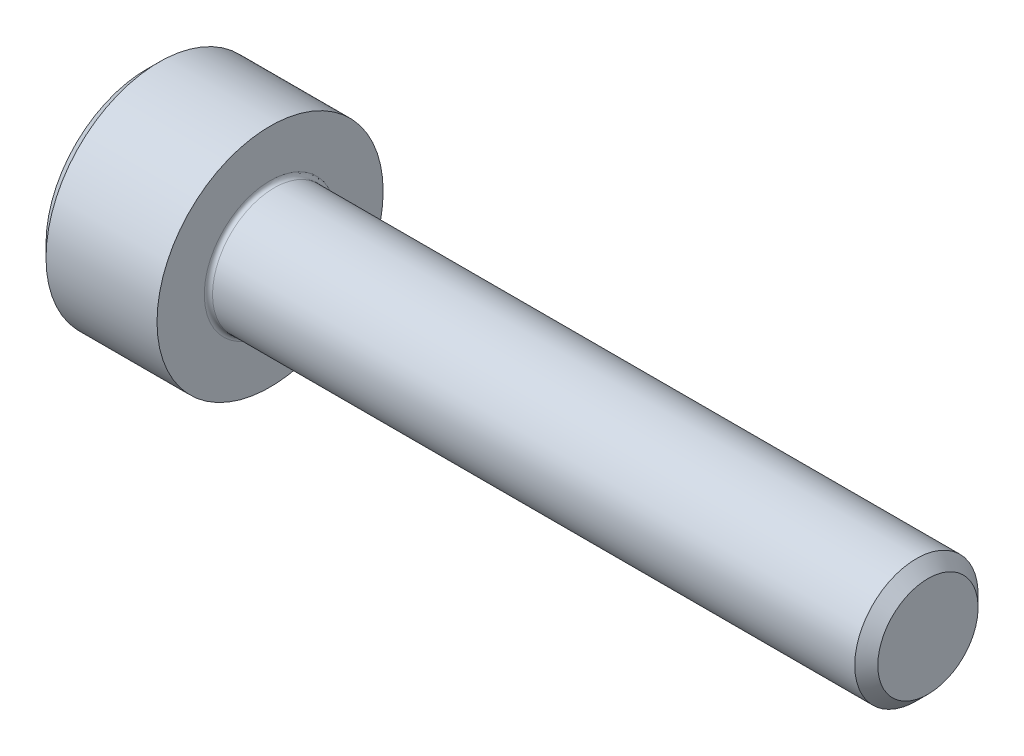
ISO-10303-21;
HEADER;
FILE_DESCRIPTION(('STEP AP214'),'2;1');
FILE_NAME('part.step','',(''),(''),'','','');
FILE_SCHEMA(('AUTOMOTIVE_DESIGN { 1 0 10303 214 1 1 1 1 }'));
ENDSEC;
DATA;
#1=APPLICATION_CONTEXT('core data for automotive mechanical design processes');
#2=APPLICATION_PROTOCOL_DEFINITION('international standard','automotive_design',2000,#1);
#3=PRODUCT_CONTEXT('',#1,'mechanical');
#4=PRODUCT('Part','Part','',(#3));
#5=PRODUCT_RELATED_PRODUCT_CATEGORY('part','',(#4));
#6=PRODUCT_DEFINITION_FORMATION('','',#4);
#7=PRODUCT_DEFINITION_CONTEXT('part definition',#1,'design');
#8=PRODUCT_DEFINITION('design','',#6,#7);
#9=PRODUCT_DEFINITION_SHAPE('','',#8);
#10=(LENGTH_UNIT() NAMED_UNIT(*) SI_UNIT(.MILLI.,.METRE.));
#11=(NAMED_UNIT(*) PLANE_ANGLE_UNIT() SI_UNIT($,.RADIAN.));
#12=(NAMED_UNIT(*) SI_UNIT($,.STERADIAN.) SOLID_ANGLE_UNIT());
#13=UNCERTAINTY_MEASURE_WITH_UNIT(LENGTH_MEASURE(1.E-05),#10,'distance_accuracy_value','');
#14=(GEOMETRIC_REPRESENTATION_CONTEXT(3) GLOBAL_UNCERTAINTY_ASSIGNED_CONTEXT((#13)) GLOBAL_UNIT_ASSIGNED_CONTEXT((#10,
#11,#12)) REPRESENTATION_CONTEXT('',''));
#15=CARTESIAN_POINT('',(0.,0.,0.));
#16=DIRECTION('',(0.,0.,1.));
#17=DIRECTION('',(1.,0.,0.));
#18=AXIS2_PLACEMENT_3D('',#15,#16,#17);
#19=CARTESIAN_POINT('',(0.,0.,0.));
#20=DIRECTION('',(-1.,0.,0.));
#21=DIRECTION('',(0.,0.,1.));
#22=AXIS2_PLACEMENT_3D('',#19,#20,#21);
#23=PLANE('',#22);
#24=DIRECTION('',(0.,-0.5,0.86602540378444));
#25=VECTOR('',#24,1.);
#26=CARTESIAN_POINT('',(0.,1.47801668912544,0.));
#27=LINE('',#26,#25);
#28=CARTESIAN_POINT('',(0.,1.47801668912544,0.));
#29=VERTEX_POINT('',#28);
#30=CARTESIAN_POINT('',(0.,0.73900834456272,1.28));
#31=VERTEX_POINT('',#30);
#32=EDGE_CURVE('E247',#29,#31,#27,.T.);
#33=ORIENTED_EDGE('',*,*,#32,.T.);
#34=DIRECTION('',(0.,1.,0.));
#35=VECTOR('',#34,1.);
#36=CARTESIAN_POINT('',(0.,-0.739008344562722,1.28));
#37=LINE('',#36,#35);
#38=CARTESIAN_POINT('',(0.,-0.739008344562722,1.28));
#39=VERTEX_POINT('',#38);
#40=EDGE_CURVE('E113',#39,#31,#37,.T.);
#41=ORIENTED_EDGE('',*,*,#40,.F.);
#42=DIRECTION('',(0.,-0.5,-0.866025403784438));
#43=VECTOR('',#42,1.);
#44=CARTESIAN_POINT('',(0.,-0.739008344562722,1.28));
#45=LINE('',#44,#43);
#46=CARTESIAN_POINT('',(0.,-1.47801668912544,0.));
#47=VERTEX_POINT('',#46);
#48=EDGE_CURVE('E250',#39,#47,#45,.T.);
#49=ORIENTED_EDGE('',*,*,#48,.T.);
#50=DIRECTION('',(0.,0.5,-0.86602540378444));
#51=VECTOR('',#50,1.);
#52=CARTESIAN_POINT('',(0.,-1.47801668912544,0.));
#53=LINE('',#52,#51);
#54=CARTESIAN_POINT('',(0.,-0.739008344562726,-1.28));
#55=VERTEX_POINT('',#54);
#56=EDGE_CURVE('E253',#47,#55,#53,.T.);
#57=ORIENTED_EDGE('',*,*,#56,.T.);
#58=DIRECTION('',(0.,-1.,0.));
#59=VECTOR('',#58,1.);
#60=CARTESIAN_POINT('',(0.,0.739008344562716,-1.28));
#61=LINE('',#60,#59);
#62=CARTESIAN_POINT('',(0.,0.739008344562716,-1.28));
#63=VERTEX_POINT('',#62);
#64=EDGE_CURVE('E256',#63,#55,#61,.T.);
#65=ORIENTED_EDGE('',*,*,#64,.F.);
#66=DIRECTION('',(0.,-0.5,-0.866025403784438));
#67=VECTOR('',#66,1.);
#68=CARTESIAN_POINT('',(0.,1.47801668912544,0.));
#69=LINE('',#68,#67);
#70=EDGE_CURVE('E108',#29,#63,#69,.T.);
#71=ORIENTED_EDGE('',*,*,#70,.F.);
#72=EDGE_LOOP('',(#33,#41,#49,#57,#65,#71));
#73=FACE_BOUND('',#72,.T.);
#74=CARTESIAN_POINT('',(0.,0.,0.));
#75=DIRECTION('',(-1.,0.,0.));
#76=DIRECTION('',(0.,0.,1.));
#77=AXIS2_PLACEMENT_3D('',#74,#75,#76);
#78=CIRCLE('',#77,2.45);
#79=CARTESIAN_POINT('',(0.,0.,2.45));
#80=VERTEX_POINT('',#79);
#81=EDGE_CURVE('E137',#80,#80,#78,.T.);
#82=ORIENTED_EDGE('',*,*,#81,.T.);
#83=EDGE_LOOP('',(#82));
#84=FACE_BOUND('',#83,.T.);
#85=ADVANCED_FACE('F17',(#73,#84),#23,.T.);
#86=CARTESIAN_POINT('',(0.,0.,0.));
#87=DIRECTION('',(1.,0.,0.));
#88=DIRECTION('',(0.,0.,-1.));
#89=AXIS2_PLACEMENT_3D('',#86,#87,#88);
#90=CONICAL_SURFACE('',#89,2.45,0.785398163397447);
#91=CARTESIAN_POINT('',(0.3,0.,0.));
#92=DIRECTION('',(-1.,0.,0.));
#93=DIRECTION('',(0.,0.,1.));
#94=AXIS2_PLACEMENT_3D('',#91,#92,#93);
#95=CIRCLE('',#94,2.75);
#96=CARTESIAN_POINT('',(0.3,0.,2.75));
#97=VERTEX_POINT('',#96);
#98=EDGE_CURVE('E134',#97,#97,#95,.T.);
#99=ORIENTED_EDGE('',*,*,#98,.T.);
#100=EDGE_LOOP('',(#99));
#101=FACE_BOUND('',#100,.T.);
#102=ORIENTED_EDGE('',*,*,#81,.F.);
#103=EDGE_LOOP('',(#102));
#104=FACE_BOUND('',#103,.T.);
#105=ADVANCED_FACE('F160',(#101,#104),#90,.T.);
#106=CARTESIAN_POINT('',(-31.75,0.,0.));
#107=DIRECTION('',(-1.,0.,0.));
#108=DIRECTION('',(0.,0.,1.));
#109=AXIS2_PLACEMENT_3D('',#106,#107,#108);
#110=CYLINDRICAL_SURFACE('',#109,2.75);
#111=CARTESIAN_POINT('',(3.,0.,0.));
#112=DIRECTION('',(-1.,0.,0.));
#113=DIRECTION('',(0.,0.,1.));
#114=AXIS2_PLACEMENT_3D('',#111,#112,#113);
#115=CIRCLE('',#114,2.75);
#116=CARTESIAN_POINT('',(3.,0.,2.75));
#117=VERTEX_POINT('',#116);
#118=EDGE_CURVE('E131',#117,#117,#115,.T.);
#119=ORIENTED_EDGE('',*,*,#118,.T.);
#120=EDGE_LOOP('',(#119));
#121=FACE_BOUND('',#120,.T.);
#122=ORIENTED_EDGE('',*,*,#98,.F.);
#123=EDGE_LOOP('',(#122));
#124=FACE_BOUND('',#123,.T.);
#125=ADVANCED_FACE('F166',(#121,#124),#110,.T.);
#126=CARTESIAN_POINT('',(3.,2.75,0.));
#127=DIRECTION('',(1.,0.,0.));
#128=DIRECTION('',(0.,0.,-1.));
#129=AXIS2_PLACEMENT_3D('',#126,#127,#128);
#130=PLANE('',#129);
#131=CARTESIAN_POINT('',(3.,0.,0.));
#132=DIRECTION('',(1.,0.,0.));
#133=DIRECTION('',(0.,0.,-1.));
#134=AXIS2_PLACEMENT_3D('',#131,#132,#133);
#135=CIRCLE('',#134,1.6);
#136=CARTESIAN_POINT('',(3.,0.,-1.6));
#137=VERTEX_POINT('',#136);
#138=EDGE_CURVE('E25',#137,#137,#135,.F.);
#139=ORIENTED_EDGE('',*,*,#138,.T.);
#140=EDGE_LOOP('',(#139));
#141=FACE_BOUND('',#140,.T.);
#142=ORIENTED_EDGE('',*,*,#118,.F.);
#143=EDGE_LOOP('',(#142));
#144=FACE_BOUND('',#143,.T.);
#145=ADVANCED_FACE('F142',(#141,#144),#130,.T.);
#146=CARTESIAN_POINT('',(-31.75,0.,0.));
#147=DIRECTION('',(-1.,0.,0.));
#148=DIRECTION('',(0.,0.,1.));
#149=AXIS2_PLACEMENT_3D('',#146,#147,#148);
#150=CYLINDRICAL_SURFACE('',#149,1.5);
#151=CARTESIAN_POINT('',(3.1,0.,0.));
#152=DIRECTION('',(1.,0.,0.));
#153=DIRECTION('',(0.,0.,-1.));
#154=AXIS2_PLACEMENT_3D('',#151,#152,#153);
#155=CIRCLE('',#154,1.5);
#156=CARTESIAN_POINT('',(3.1,0.,-1.5));
#157=VERTEX_POINT('',#156);
#158=EDGE_CURVE('E11',#157,#157,#155,.T.);
#159=ORIENTED_EDGE('',*,*,#158,.T.);
#160=EDGE_LOOP('',(#159));
#161=FACE_BOUND('',#160,.T.);
#162=CARTESIAN_POINT('',(18.7195,0.,0.));
#163=DIRECTION('',(-1.,0.,0.));
#164=DIRECTION('',(0.,0.,1.));
#165=AXIS2_PLACEMENT_3D('',#162,#163,#164);
#166=CIRCLE('',#165,1.49999999999998);
#167=CARTESIAN_POINT('',(18.7195,0.,1.49999999999998));
#168=VERTEX_POINT('',#167);
#169=EDGE_CURVE('E128',#168,#168,#166,.T.);
#170=ORIENTED_EDGE('',*,*,#169,.T.);
#171=EDGE_LOOP('',(#170));
#172=FACE_BOUND('',#171,.T.);
#173=ADVANCED_FACE('F176',(#161,#172),#150,.T.);
#174=CARTESIAN_POINT('',(19.,0.,0.));
#175=DIRECTION('',(-1.,0.,0.));
#176=DIRECTION('',(0.,0.,1.));
#177=AXIS2_PLACEMENT_3D('',#174,#175,#176);
#178=CONICAL_SURFACE('',#177,1.2195,0.785398163397381);
#179=ORIENTED_EDGE('',*,*,#169,.F.);
#180=EDGE_LOOP('',(#179));
#181=FACE_BOUND('',#180,.T.);
#182=CARTESIAN_POINT('',(19.,0.,0.));
#183=DIRECTION('',(-1.,0.,0.));
#184=DIRECTION('',(0.,0.,1.));
#185=AXIS2_PLACEMENT_3D('',#182,#183,#184);
#186=CIRCLE('',#185,1.2195);
#187=CARTESIAN_POINT('',(19.,0.,1.2195));
#188=VERTEX_POINT('',#187);
#189=EDGE_CURVE('E124',#188,#188,#186,.T.);
#190=ORIENTED_EDGE('',*,*,#189,.T.);
#191=EDGE_LOOP('',(#190));
#192=FACE_BOUND('',#191,.T.);
#193=ADVANCED_FACE('F155',(#181,#192),#178,.T.);
#194=CARTESIAN_POINT('',(19.,1.2195,0.));
#195=DIRECTION('',(1.,0.,0.));
#196=DIRECTION('',(0.,0.,-1.));
#197=AXIS2_PLACEMENT_3D('',#194,#195,#196);
#198=PLANE('',#197);
#199=ORIENTED_EDGE('',*,*,#189,.F.);
#200=EDGE_LOOP('',(#199));
#201=FACE_BOUND('',#200,.T.);
#202=ADVANCED_FACE('F146',(#201),#198,.T.);
#203=CARTESIAN_POINT('',(3.1,0.,0.));
#204=DIRECTION('',(1.,0.,0.));
#205=DIRECTION('',(0.,0.,-1.));
#206=AXIS2_PLACEMENT_3D('',#203,#204,#205);
#207=TOROIDAL_SURFACE('',#206,1.6,0.1);
#208=ORIENTED_EDGE('',*,*,#158,.F.);
#209=EDGE_LOOP('',(#208));
#210=FACE_BOUND('',#209,.T.);
#211=ORIENTED_EDGE('',*,*,#138,.F.);
#212=EDGE_LOOP('',(#211));
#213=FACE_BOUND('',#212,.T.);
#214=ADVANCED_FACE('F19',(#210,#213),#207,.F.);
#215=CARTESIAN_POINT('',(1.3,1.47801668912544,0.));
#216=DIRECTION('',(0.,-0.86602540378444,-0.5));
#217=DIRECTION('',(0.,0.5,-0.86602540378444));
#218=AXIS2_PLACEMENT_3D('',#215,#216,#217);
#219=PLANE('',#218);
#220=ORIENTED_EDGE('',*,*,#32,.F.);
#221=DIRECTION('',(-1.,0.,0.));
#222=VECTOR('',#221,1.);
#223=CARTESIAN_POINT('',(1.3,1.47801668912544,0.));
#224=LINE('',#223,#222);
#225=CARTESIAN_POINT('',(1.3,1.47801668912544,0.));
#226=VERTEX_POINT('',#225);
#227=EDGE_CURVE('E237',#226,#29,#224,.T.);
#228=ORIENTED_EDGE('',*,*,#227,.F.);
#229=DIRECTION('',(0.,-0.5,0.86602540378444));
#230=VECTOR('',#229,1.);
#231=CARTESIAN_POINT('',(1.3,1.47801668912544,0.));
#232=LINE('',#231,#230);
#233=CARTESIAN_POINT('',(1.3,1.10851251684408,0.64));
#234=VERTEX_POINT('',#233);
#235=EDGE_CURVE('E100',#226,#234,#232,.T.);
#236=ORIENTED_EDGE('',*,*,#235,.T.);
#237=CARTESIAN_POINT('',(1.3,0.73900834456272,1.28));
#238=VERTEX_POINT('',#237);
#239=EDGE_CURVE('E91',#234,#238,#232,.T.);
#240=ORIENTED_EDGE('',*,*,#239,.T.);
#241=DIRECTION('',(-1.,0.,0.));
#242=VECTOR('',#241,1.);
#243=CARTESIAN_POINT('',(1.3,0.73900834456272,1.28));
#244=LINE('',#243,#242);
#245=EDGE_CURVE('E105',#238,#31,#244,.T.);
#246=ORIENTED_EDGE('',*,*,#245,.T.);
#247=EDGE_LOOP('',(#220,#228,#236,#240,#246));
#248=FACE_BOUND('',#247,.T.);
#249=ADVANCED_FACE('F104',(#248),#219,.T.);
#250=CARTESIAN_POINT('',(1.3,-0.739008344562722,1.28));
#251=DIRECTION('',(0.,0.,1.));
#252=DIRECTION('',(0.,-1.,0.));
#253=AXIS2_PLACEMENT_3D('',#250,#251,#252);
#254=PLANE('',#253);
#255=ORIENTED_EDGE('',*,*,#40,.T.);
#256=ORIENTED_EDGE('',*,*,#245,.F.);
#257=DIRECTION('',(0.,1.,0.));
#258=VECTOR('',#257,1.);
#259=CARTESIAN_POINT('',(1.3,-0.739008344562722,1.28));
#260=LINE('',#259,#258);
#261=CARTESIAN_POINT('',(1.3,0.,1.28));
#262=VERTEX_POINT('',#261);
#263=EDGE_CURVE('E88',#262,#238,#260,.T.);
#264=ORIENTED_EDGE('',*,*,#263,.F.);
#265=CARTESIAN_POINT('',(1.3,-0.739008344562722,1.28));
#266=VERTEX_POINT('',#265);
#267=EDGE_CURVE('E99',#266,#262,#260,.T.);
#268=ORIENTED_EDGE('',*,*,#267,.F.);
#269=DIRECTION('',(-1.,0.,0.));
#270=VECTOR('',#269,1.);
#271=CARTESIAN_POINT('',(1.3,-0.739008344562722,1.28));
#272=LINE('',#271,#270);
#273=EDGE_CURVE('E115',#266,#39,#272,.T.);
#274=ORIENTED_EDGE('',*,*,#273,.T.);
#275=EDGE_LOOP('',(#255,#256,#264,#268,#274));
#276=FACE_BOUND('',#275,.T.);
#277=ADVANCED_FACE('F110',(#276),#254,.F.);
#278=CARTESIAN_POINT('',(1.3,-0.739008344562722,1.28));
#279=DIRECTION('',(0.,0.866025403784438,-0.5));
#280=DIRECTION('',(0.,0.5,0.866025403784438));
#281=AXIS2_PLACEMENT_3D('',#278,#279,#280);
#282=PLANE('',#281);
#283=ORIENTED_EDGE('',*,*,#48,.F.);
#284=ORIENTED_EDGE('',*,*,#273,.F.);
#285=DIRECTION('',(0.,-0.5,-0.866025403784438));
#286=VECTOR('',#285,1.);
#287=CARTESIAN_POINT('',(1.3,-0.739008344562722,1.28));
#288=LINE('',#287,#286);
#289=CARTESIAN_POINT('',(1.3,-1.10851251684408,0.64));
#290=VERTEX_POINT('',#289);
#291=EDGE_CURVE('E276',#266,#290,#288,.T.);
#292=ORIENTED_EDGE('',*,*,#291,.T.);
#293=CARTESIAN_POINT('',(1.3,-1.47801668912544,0.));
#294=VERTEX_POINT('',#293);
#295=EDGE_CURVE('E265',#290,#294,#288,.T.);
#296=ORIENTED_EDGE('',*,*,#295,.T.);
#297=DIRECTION('',(-1.,0.,0.));
#298=VECTOR('',#297,1.);
#299=CARTESIAN_POINT('',(1.3,-1.47801668912544,0.));
#300=LINE('',#299,#298);
#301=EDGE_CURVE('E120',#294,#47,#300,.T.);
#302=ORIENTED_EDGE('',*,*,#301,.T.);
#303=EDGE_LOOP('',(#283,#284,#292,#296,#302));
#304=FACE_BOUND('',#303,.T.);
#305=ADVANCED_FACE('F189',(#304),#282,.T.);
#306=CARTESIAN_POINT('',(1.3,-1.47801668912544,0.));
#307=DIRECTION('',(0.,0.86602540378444,0.5));
#308=DIRECTION('',(0.,-0.5,0.86602540378444));
#309=AXIS2_PLACEMENT_3D('',#306,#307,#308);
#310=PLANE('',#309);
#311=ORIENTED_EDGE('',*,*,#56,.F.);
#312=ORIENTED_EDGE('',*,*,#301,.F.);
#313=DIRECTION('',(0.,0.5,-0.86602540378444));
#314=VECTOR('',#313,1.);
#315=CARTESIAN_POINT('',(1.3,-1.47801668912544,0.));
#316=LINE('',#315,#314);
#317=CARTESIAN_POINT('',(1.3,-1.10851251684409,-0.64));
#318=VERTEX_POINT('',#317);
#319=EDGE_CURVE('E243',#294,#318,#316,.T.);
#320=ORIENTED_EDGE('',*,*,#319,.T.);
#321=CARTESIAN_POINT('',(1.3,-0.739008344562726,-1.28));
#322=VERTEX_POINT('',#321);
#323=EDGE_CURVE('E275',#318,#322,#316,.T.);
#324=ORIENTED_EDGE('',*,*,#323,.T.);
#325=DIRECTION('',(-1.,0.,0.));
#326=VECTOR('',#325,1.);
#327=CARTESIAN_POINT('',(1.3,-0.739008344562726,-1.28));
#328=LINE('',#327,#326);
#329=EDGE_CURVE('E236',#322,#55,#328,.T.);
#330=ORIENTED_EDGE('',*,*,#329,.T.);
#331=EDGE_LOOP('',(#311,#312,#320,#324,#330));
#332=FACE_BOUND('',#331,.T.);
#333=ADVANCED_FACE('F192',(#332),#310,.T.);
#334=CARTESIAN_POINT('',(1.3,0.739008344562716,-1.28));
#335=DIRECTION('',(0.,0.,-1.));
#336=DIRECTION('',(0.,1.,0.));
#337=AXIS2_PLACEMENT_3D('',#334,#335,#336);
#338=PLANE('',#337);
#339=ORIENTED_EDGE('',*,*,#64,.T.);
#340=ORIENTED_EDGE('',*,*,#329,.F.);
#341=DIRECTION('',(0.,-1.,0.));
#342=VECTOR('',#341,1.);
#343=CARTESIAN_POINT('',(1.3,0.739008344562716,-1.28));
#344=LINE('',#343,#342);
#345=CARTESIAN_POINT('',(1.3,0.,-1.28));
#346=VERTEX_POINT('',#345);
#347=EDGE_CURVE('E240',#346,#322,#344,.T.);
#348=ORIENTED_EDGE('',*,*,#347,.F.);
#349=CARTESIAN_POINT('',(1.3,0.739008344562716,-1.28));
#350=VERTEX_POINT('',#349);
#351=EDGE_CURVE('E32',#350,#346,#344,.T.);
#352=ORIENTED_EDGE('',*,*,#351,.F.);
#353=DIRECTION('',(-1.,0.,0.));
#354=VECTOR('',#353,1.);
#355=CARTESIAN_POINT('',(1.3,0.739008344562716,-1.28));
#356=LINE('',#355,#354);
#357=EDGE_CURVE('E233',#350,#63,#356,.T.);
#358=ORIENTED_EDGE('',*,*,#357,.T.);
#359=EDGE_LOOP('',(#339,#340,#348,#352,#358));
#360=FACE_BOUND('',#359,.T.);
#361=ADVANCED_FACE('F196',(#360),#338,.F.);
#362=CARTESIAN_POINT('',(1.3,1.47801668912544,0.));
#363=DIRECTION('',(0.,0.866025403784438,-0.5));
#364=DIRECTION('',(0.,0.5,0.866025403784438));
#365=AXIS2_PLACEMENT_3D('',#362,#363,#364);
#366=PLANE('',#365);
#367=ORIENTED_EDGE('',*,*,#70,.T.);
#368=ORIENTED_EDGE('',*,*,#357,.F.);
#369=DIRECTION('',(0.,-0.5,-0.866025403784438));
#370=VECTOR('',#369,1.);
#371=CARTESIAN_POINT('',(1.3,1.47801668912544,0.));
#372=LINE('',#371,#370);
#373=CARTESIAN_POINT('',(1.3,1.10851251684408,-0.64));
#374=VERTEX_POINT('',#373);
#375=EDGE_CURVE('E223',#374,#350,#372,.T.);
#376=ORIENTED_EDGE('',*,*,#375,.F.);
#377=EDGE_CURVE('E229',#226,#374,#372,.T.);
#378=ORIENTED_EDGE('',*,*,#377,.F.);
#379=ORIENTED_EDGE('',*,*,#227,.T.);
#380=EDGE_LOOP('',(#367,#368,#376,#378,#379));
#381=FACE_BOUND('',#380,.T.);
#382=ADVANCED_FACE('F200',(#381),#366,.F.);
#383=CARTESIAN_POINT('',(1.3,2.21702503368815,-1.28));
#384=DIRECTION('',(1.,0.,0.));
#385=DIRECTION('',(0.,0.,-1.));
#386=AXIS2_PLACEMENT_3D('',#383,#384,#385);
#387=PLANE('',#386);
#388=ORIENTED_EDGE('',*,*,#347,.T.);
#389=ORIENTED_EDGE('',*,*,#323,.F.);
#390=CARTESIAN_POINT('',(1.3,0.,0.));
#391=DIRECTION('',(-1.,0.,0.));
#392=DIRECTION('',(0.,0.,1.));
#393=AXIS2_PLACEMENT_3D('',#390,#391,#392);
#394=CIRCLE('',#393,1.28);
#395=EDGE_CURVE('E271',#346,#318,#394,.T.);
#396=ORIENTED_EDGE('',*,*,#395,.F.);
#397=EDGE_LOOP('',(#388,#389,#396));
#398=FACE_BOUND('',#397,.T.);
#399=ADVANCED_FACE('F204',(#398),#387,.F.);
#400=ORIENTED_EDGE('',*,*,#319,.F.);
#401=ORIENTED_EDGE('',*,*,#295,.F.);
#402=EDGE_CURVE('E118',#318,#290,#394,.T.);
#403=ORIENTED_EDGE('',*,*,#402,.F.);
#404=EDGE_LOOP('',(#400,#401,#403));
#405=FACE_BOUND('',#404,.T.);
#406=ADVANCED_FACE('F207',(#405),#387,.F.);
#407=ORIENTED_EDGE('',*,*,#291,.F.);
#408=ORIENTED_EDGE('',*,*,#267,.T.);
#409=EDGE_CURVE('E114',#290,#262,#394,.T.);
#410=ORIENTED_EDGE('',*,*,#409,.F.);
#411=EDGE_LOOP('',(#407,#408,#410));
#412=FACE_BOUND('',#411,.T.);
#413=ADVANCED_FACE('F213',(#412),#387,.F.);
#414=ORIENTED_EDGE('',*,*,#263,.T.);
#415=ORIENTED_EDGE('',*,*,#239,.F.);
#416=EDGE_CURVE('E94',#262,#234,#394,.T.);
#417=ORIENTED_EDGE('',*,*,#416,.F.);
#418=EDGE_LOOP('',(#414,#415,#417));
#419=FACE_BOUND('',#418,.T.);
#420=ADVANCED_FACE('F90',(#419),#387,.F.);
#421=ORIENTED_EDGE('',*,*,#235,.F.);
#422=ORIENTED_EDGE('',*,*,#377,.T.);
#423=EDGE_CURVE('E125',#234,#374,#394,.T.);
#424=ORIENTED_EDGE('',*,*,#423,.F.);
#425=EDGE_LOOP('',(#421,#422,#424));
#426=FACE_BOUND('',#425,.T.);
#427=ADVANCED_FACE('F216',(#426),#387,.F.);
#428=ORIENTED_EDGE('',*,*,#375,.T.);
#429=ORIENTED_EDGE('',*,*,#351,.T.);
#430=EDGE_CURVE('E226',#374,#346,#394,.T.);
#431=ORIENTED_EDGE('',*,*,#430,.F.);
#432=EDGE_LOOP('',(#428,#429,#431));
#433=FACE_BOUND('',#432,.T.);
#434=ADVANCED_FACE('F185',(#433),#387,.F.);
#435=CARTESIAN_POINT('',(1.3,0.,0.));
#436=DIRECTION('',(-1.,0.,0.));
#437=DIRECTION('',(0.,0.,1.));
#438=AXIS2_PLACEMENT_3D('',#435,#436,#437);
#439=CONICAL_SURFACE('',#438,1.28,1.0471975511966);
#440=CARTESIAN_POINT('',(2.03900834456273,0.,0.));
#441=VERTEX_POINT('',#440);
#442=VERTEX_LOOP('',#441);
#443=FACE_BOUND('',#442,.T.);
#444=ORIENTED_EDGE('',*,*,#416,.T.);
#445=ORIENTED_EDGE('',*,*,#423,.T.);
#446=ORIENTED_EDGE('',*,*,#430,.T.);
#447=ORIENTED_EDGE('',*,*,#395,.T.);
#448=ORIENTED_EDGE('',*,*,#402,.T.);
#449=ORIENTED_EDGE('',*,*,#409,.T.);
#450=EDGE_LOOP('',(#444,#445,#446,#447,#448,#449));
#451=FACE_BOUND('',#450,.T.);
#452=ADVANCED_FACE('F183',(#443,#451),#439,.F.);
#453=CLOSED_SHELL('',(#85,#105,#125,#145,#173,#193,#202,#214,#249,#277,#305,#333,#361,#382,#399,
#406,#413,#420,#427,#434,#452));
#454=MANIFOLD_SOLID_BREP('B1',#453);
#455=ADVANCED_BREP_SHAPE_REPRESENTATION('',(#18,#454),#14);
#456=SHAPE_DEFINITION_REPRESENTATION(#9,#455);
ENDSEC;
END-ISO-10303-21;
